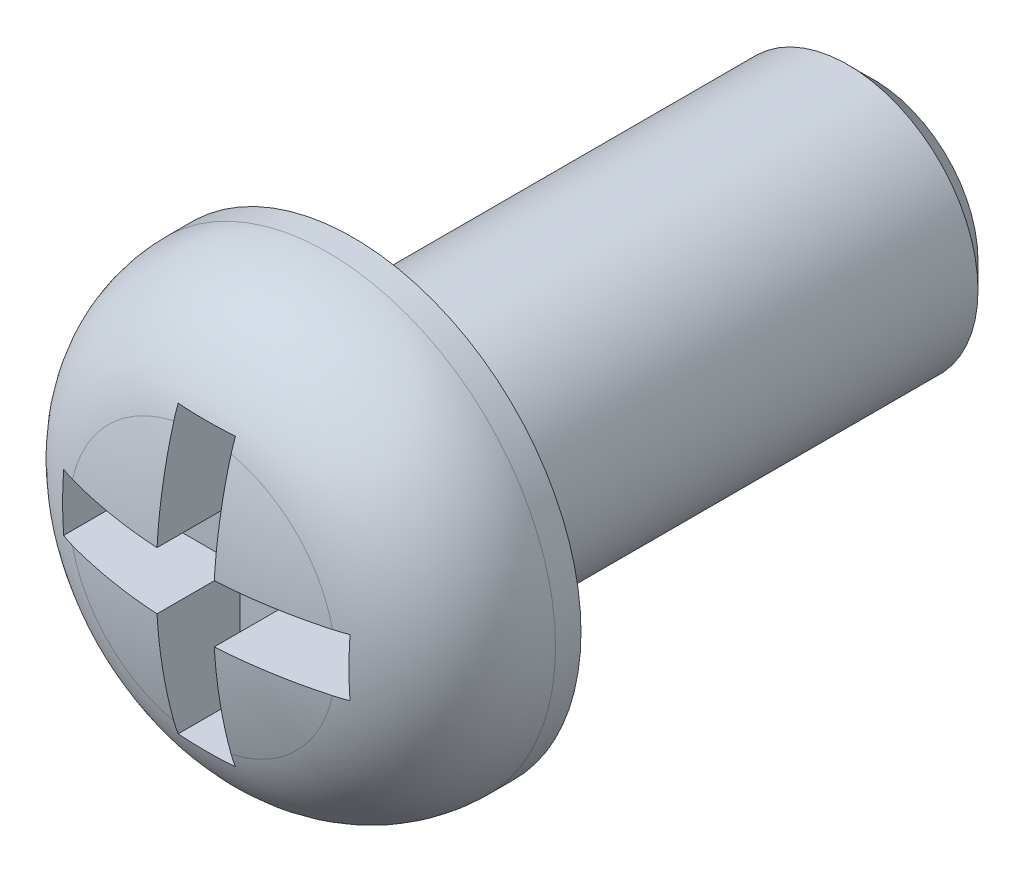
ISO-10303-21;
HEADER;
FILE_DESCRIPTION(('STEP AP214'),'2;1');
FILE_NAME('part.step','',(''),(''),'','','');
FILE_SCHEMA(('AUTOMOTIVE_DESIGN { 1 0 10303 214 1 1 1 1 }'));
ENDSEC;
DATA;
#1=APPLICATION_CONTEXT('core data for automotive mechanical design processes');
#2=APPLICATION_PROTOCOL_DEFINITION('international standard','automotive_design',2000,#1);
#3=PRODUCT_CONTEXT('',#1,'mechanical');
#4=PRODUCT('Part','Part','',(#3));
#5=PRODUCT_RELATED_PRODUCT_CATEGORY('part','',(#4));
#6=PRODUCT_DEFINITION_FORMATION('','',#4);
#7=PRODUCT_DEFINITION_CONTEXT('part definition',#1,'design');
#8=PRODUCT_DEFINITION('design','',#6,#7);
#9=PRODUCT_DEFINITION_SHAPE('','',#8);
#10=(LENGTH_UNIT() NAMED_UNIT(*) SI_UNIT(.MILLI.,.METRE.));
#11=(NAMED_UNIT(*) PLANE_ANGLE_UNIT() SI_UNIT($,.RADIAN.));
#12=(NAMED_UNIT(*) SI_UNIT($,.STERADIAN.) SOLID_ANGLE_UNIT());
#13=UNCERTAINTY_MEASURE_WITH_UNIT(LENGTH_MEASURE(1.E-05),#10,'distance_accuracy_value','');
#14=(GEOMETRIC_REPRESENTATION_CONTEXT(3) GLOBAL_UNCERTAINTY_ASSIGNED_CONTEXT((#13)) GLOBAL_UNIT_ASSIGNED_CONTEXT((#10,
#11,#12)) REPRESENTATION_CONTEXT('',''));
#15=CARTESIAN_POINT('',(0.,0.,0.));
#16=DIRECTION('',(0.,0.,1.));
#17=DIRECTION('',(1.,0.,0.));
#18=AXIS2_PLACEMENT_3D('',#15,#16,#17);
#19=CARTESIAN_POINT('',(0.,0.,-2.45032051282053));
#20=DIRECTION('',(0.,0.,1.));
#21=DIRECTION('',(0.,1.,0.));
#22=AXIS2_PLACEMENT_3D('',#19,#20,#21);
#23=SPHERICAL_SURFACE('',#22,3.75032051282053);
#24=CARTESIAN_POINT('',(-0.22,0.,-2.45032051282053));
#25=DIRECTION('',(1.,0.,0.));
#26=DIRECTION('',(0.,1.,0.));
#27=AXIS2_PLACEMENT_3D('',#24,#25,#26);
#28=CIRCLE('',#27,3.74386217012358);
#29=CARTESIAN_POINT('',(-0.22,0.998752254235364,1.1578643332679));
#30=VERTEX_POINT('',#29);
#31=CARTESIAN_POINT('',(-0.22,0.22,1.2870721543851));
#32=VERTEX_POINT('',#31);
#33=EDGE_CURVE('E190',#30,#32,#28,.T.);
#34=ORIENTED_EDGE('',*,*,#33,.F.);
#35=CARTESIAN_POINT('',(0.,0.,1.1578643332679));
#36=DIRECTION('',(0.,0.,-1.));
#37=DIRECTION('',(-1.,0.,0.));
#38=AXIS2_PLACEMENT_3D('',#35,#36,#37);
#39=CIRCLE('',#38,1.02269549003612);
#40=CARTESIAN_POINT('',(-0.998752254235368,0.22,1.1578643332679));
#41=VERTEX_POINT('',#40);
#42=EDGE_CURVE('E226',#30,#41,#39,.F.);
#43=ORIENTED_EDGE('',*,*,#42,.T.);
#44=CARTESIAN_POINT('',(0.,0.22,-2.45032051282053));
#45=DIRECTION('',(0.,-1.,0.));
#46=DIRECTION('',(1.,0.,0.));
#47=AXIS2_PLACEMENT_3D('',#44,#45,#46);
#48=CIRCLE('',#47,3.74386217012358);
#49=EDGE_CURVE('E193',#32,#41,#48,.T.);
#50=ORIENTED_EDGE('',*,*,#49,.F.);
#51=EDGE_LOOP('',(#34,#43,#50));
#52=FACE_BOUND('',#51,.T.);
#53=ADVANCED_FACE('F38',(#52),#23,.T.);
#54=CARTESIAN_POINT('',(0.,-0.22,-2.45032051282053));
#55=DIRECTION('',(0.,1.,0.));
#56=DIRECTION('',(-1.,0.,0.));
#57=AXIS2_PLACEMENT_3D('',#54,#55,#56);
#58=CIRCLE('',#57,3.74386217012358);
#59=CARTESIAN_POINT('',(-0.99875225423537,-0.22,1.1578643332679));
#60=VERTEX_POINT('',#59);
#61=CARTESIAN_POINT('',(-0.22,-0.22,1.2870721543851));
#62=VERTEX_POINT('',#61);
#63=EDGE_CURVE('E197',#60,#62,#58,.T.);
#64=ORIENTED_EDGE('',*,*,#63,.F.);
#65=CARTESIAN_POINT('',(0.,0.,1.1578643332679));
#66=DIRECTION('',(0.,0.,-1.));
#67=DIRECTION('',(-1.,0.,0.));
#68=AXIS2_PLACEMENT_3D('',#65,#66,#67);
#69=CIRCLE('',#68,1.02269549003612);
#70=CARTESIAN_POINT('',(-0.22,-0.998752254235372,1.1578643332679));
#71=VERTEX_POINT('',#70);
#72=EDGE_CURVE('E223',#60,#71,#69,.F.);
#73=ORIENTED_EDGE('',*,*,#72,.T.);
#74=CARTESIAN_POINT('',(-0.22,0.,-2.45032051282053));
#75=DIRECTION('',(1.,0.,0.));
#76=DIRECTION('',(0.,1.,0.));
#77=AXIS2_PLACEMENT_3D('',#74,#75,#76);
#78=CIRCLE('',#77,3.74386217012358);
#79=EDGE_CURVE('E200',#62,#71,#78,.T.);
#80=ORIENTED_EDGE('',*,*,#79,.F.);
#81=EDGE_LOOP('',(#64,#73,#80));
#82=FACE_BOUND('',#81,.T.);
#83=ADVANCED_FACE('F347',(#82),#23,.T.);
#84=CARTESIAN_POINT('',(0.22,0.,-2.45032051282053));
#85=DIRECTION('',(-1.,0.,0.));
#86=DIRECTION('',(0.,-1.,0.));
#87=AXIS2_PLACEMENT_3D('',#84,#85,#86);
#88=CIRCLE('',#87,3.74386217012358);
#89=CARTESIAN_POINT('',(0.22,-0.998752254235372,1.1578643332679));
#90=VERTEX_POINT('',#89);
#91=CARTESIAN_POINT('',(0.22,-0.22,1.2870721543851));
#92=VERTEX_POINT('',#91);
#93=EDGE_CURVE('E204',#90,#92,#88,.T.);
#94=ORIENTED_EDGE('',*,*,#93,.F.);
#95=CARTESIAN_POINT('',(0.,0.,1.1578643332679));
#96=DIRECTION('',(0.,0.,-1.));
#97=DIRECTION('',(-1.,0.,0.));
#98=AXIS2_PLACEMENT_3D('',#95,#96,#97);
#99=CIRCLE('',#98,1.02269549003612);
#100=CARTESIAN_POINT('',(0.998752254235369,-0.22,1.1578643332679));
#101=VERTEX_POINT('',#100);
#102=EDGE_CURVE('E220',#90,#101,#99,.F.);
#103=ORIENTED_EDGE('',*,*,#102,.T.);
#104=CARTESIAN_POINT('',(0.,-0.22,-2.45032051282053));
#105=DIRECTION('',(0.,1.,0.));
#106=DIRECTION('',(-1.,0.,0.));
#107=AXIS2_PLACEMENT_3D('',#104,#105,#106);
#108=CIRCLE('',#107,3.74386217012358);
#109=EDGE_CURVE('E207',#92,#101,#108,.T.);
#110=ORIENTED_EDGE('',*,*,#109,.F.);
#111=EDGE_LOOP('',(#94,#103,#110));
#112=FACE_BOUND('',#111,.T.);
#113=ADVANCED_FACE('F352',(#112),#23,.T.);
#114=CARTESIAN_POINT('',(0.,0.22,-2.45032051282053));
#115=DIRECTION('',(0.,-1.,0.));
#116=DIRECTION('',(1.,0.,0.));
#117=AXIS2_PLACEMENT_3D('',#114,#115,#116);
#118=CIRCLE('',#117,3.74386217012358);
#119=CARTESIAN_POINT('',(0.998752254235368,0.22,1.1578643332679));
#120=VERTEX_POINT('',#119);
#121=CARTESIAN_POINT('',(0.22,0.22,1.2870721543851));
#122=VERTEX_POINT('',#121);
#123=EDGE_CURVE('E211',#120,#122,#118,.T.);
#124=ORIENTED_EDGE('',*,*,#123,.F.);
#125=CARTESIAN_POINT('',(0.,0.,1.1578643332679));
#126=DIRECTION('',(0.,0.,-1.));
#127=DIRECTION('',(-1.,0.,0.));
#128=AXIS2_PLACEMENT_3D('',#125,#126,#127);
#129=CIRCLE('',#128,1.02269549003612);
#130=CARTESIAN_POINT('',(0.22,0.998752254235364,1.1578643332679));
#131=VERTEX_POINT('',#130);
#132=EDGE_CURVE('E217',#120,#131,#129,.F.);
#133=ORIENTED_EDGE('',*,*,#132,.T.);
#134=CARTESIAN_POINT('',(0.22,0.,-2.45032051282053));
#135=DIRECTION('',(-1.,0.,0.));
#136=DIRECTION('',(0.,-1.,0.));
#137=AXIS2_PLACEMENT_3D('',#134,#135,#136);
#138=CIRCLE('',#137,3.74386217012358);
#139=EDGE_CURVE('E214',#122,#131,#138,.T.);
#140=ORIENTED_EDGE('',*,*,#139,.F.);
#141=EDGE_LOOP('',(#124,#133,#140));
#142=FACE_BOUND('',#141,.T.);
#143=ADVANCED_FACE('F253',(#142),#23,.T.);
#144=CARTESIAN_POINT('',(0.,0.,33.7359697729939));
#145=DIRECTION('',(0.,0.,1.));
#146=DIRECTION('',(1.,0.,0.));
#147=AXIS2_PLACEMENT_3D('',#144,#145,#146);
#148=CYLINDRICAL_SURFACE('',#147,1.75);
#149=CARTESIAN_POINT('',(0.,0.,0.195763938447301));
#150=DIRECTION('',(0.,0.,-1.));
#151=DIRECTION('',(-1.,0.,0.));
#152=AXIS2_PLACEMENT_3D('',#149,#150,#151);
#153=CIRCLE('',#152,1.75);
#154=CARTESIAN_POINT('',(-1.75,0.,0.195763938447301));
#155=VERTEX_POINT('',#154);
#156=EDGE_CURVE('E484',#155,#155,#153,.T.);
#157=ORIENTED_EDGE('',*,*,#156,.T.);
#158=EDGE_LOOP('',(#157));
#159=FACE_BOUND('',#158,.T.);
#160=CARTESIAN_POINT('',(0.,0.,0.));
#161=DIRECTION('',(0.,0.,1.));
#162=DIRECTION('',(1.,0.,0.));
#163=AXIS2_PLACEMENT_3D('',#160,#161,#162);
#164=CIRCLE('',#163,1.75);
#165=CARTESIAN_POINT('',(1.75,0.,0.));
#166=VERTEX_POINT('',#165);
#167=EDGE_CURVE('E180',#166,#166,#164,.T.);
#168=ORIENTED_EDGE('',*,*,#167,.T.);
#169=EDGE_LOOP('',(#168));
#170=FACE_BOUND('',#169,.T.);
#171=ADVANCED_FACE('F356',(#159,#170),#148,.T.);
#172=CARTESIAN_POINT('',(0.,1.75,0.));
#173=DIRECTION('',(0.,0.,1.));
#174=DIRECTION('',(1.,0.,0.));
#175=AXIS2_PLACEMENT_3D('',#172,#173,#174);
#176=PLANE('',#175);
#177=ORIENTED_EDGE('',*,*,#167,.F.);
#178=EDGE_LOOP('',(#177));
#179=FACE_BOUND('',#178,.T.);
#180=CARTESIAN_POINT('',(0.,0.,0.));
#181=DIRECTION('',(0.,0.,1.));
#182=DIRECTION('',(1.,0.,0.));
#183=AXIS2_PLACEMENT_3D('',#180,#181,#182);
#184=CIRCLE('',#183,1.);
#185=CARTESIAN_POINT('',(1.,0.,0.));
#186=VERTEX_POINT('',#185);
#187=EDGE_CURVE('E173',#186,#186,#184,.T.);
#188=ORIENTED_EDGE('',*,*,#187,.T.);
#189=EDGE_LOOP('',(#188));
#190=FACE_BOUND('',#189,.T.);
#191=ADVANCED_FACE('F362',(#179,#190),#176,.F.);
#192=CARTESIAN_POINT('',(0.,0.,33.7359697729939));
#193=DIRECTION('',(0.,0.,1.));
#194=DIRECTION('',(1.,0.,0.));
#195=AXIS2_PLACEMENT_3D('',#192,#193,#194);
#196=CYLINDRICAL_SURFACE('',#195,1.);
#197=CARTESIAN_POINT('',(0.,0.,-3.8));
#198=DIRECTION('',(0.,0.,1.));
#199=DIRECTION('',(1.,0.,0.));
#200=AXIS2_PLACEMENT_3D('',#197,#198,#199);
#201=CIRCLE('',#200,1.);
#202=CARTESIAN_POINT('',(1.,0.,-3.8));
#203=VERTEX_POINT('',#202);
#204=EDGE_CURVE('E47',#203,#203,#201,.T.);
#205=ORIENTED_EDGE('',*,*,#204,.T.);
#206=EDGE_LOOP('',(#205));
#207=FACE_BOUND('',#206,.T.);
#208=ORIENTED_EDGE('',*,*,#187,.F.);
#209=EDGE_LOOP('',(#208));
#210=FACE_BOUND('',#209,.T.);
#211=ADVANCED_FACE('F491',(#207,#210),#196,.T.);
#212=CARTESIAN_POINT('',(0.,1.,-4.));
#213=DIRECTION('',(0.,0.,1.));
#214=DIRECTION('',(1.,0.,0.));
#215=AXIS2_PLACEMENT_3D('',#212,#213,#214);
#216=PLANE('',#215);
#217=CARTESIAN_POINT('',(0.,0.,-4.));
#218=DIRECTION('',(0.,0.,1.));
#219=DIRECTION('',(1.,0.,0.));
#220=AXIS2_PLACEMENT_3D('',#217,#218,#219);
#221=CIRCLE('',#220,0.800000000000003);
#222=CARTESIAN_POINT('',(0.800000000000003,0.,-4.));
#223=VERTEX_POINT('',#222);
#224=EDGE_CURVE('E11',#223,#223,#221,.F.);
#225=ORIENTED_EDGE('',*,*,#224,.T.);
#226=EDGE_LOOP('',(#225));
#227=FACE_BOUND('',#226,.T.);
#228=ADVANCED_FACE('F500',(#227),#216,.F.);
#229=CARTESIAN_POINT('',(0.22,0.22,0.65));
#230=DIRECTION('',(-1.,0.,0.));
#231=DIRECTION('',(0.,-1.,0.));
#232=AXIS2_PLACEMENT_3D('',#229,#230,#231);
#233=PLANE('',#232);
#234=ORIENTED_EDGE('',*,*,#139,.T.);
#235=CARTESIAN_POINT('',(0.22,0.998752254235364,1.1578643332679));
#236=CARTESIAN_POINT('',(0.22,1.01592019967968,1.15311330343602));
#237=CARTESIAN_POINT('',(0.22,1.0329414774564,1.14792268735521));
#238=CARTESIAN_POINT('',(0.22,1.06669072654649,1.13666227306266));
#239=CARTESIAN_POINT('',(0.22,1.083418697358,1.13059247334668));
#240=CARTESIAN_POINT('',(0.22,1.1,1.12408308587755));
#241=B_SPLINE_CURVE_WITH_KNOTS('',3,(#235,#236,#237,#238,#239,#240),.UNSPECIFIED.,.F.,.F.,(4,2,
4),(0.,0.0533853681457087,0.106770827632),.UNSPECIFIED.);
#242=CARTESIAN_POINT('',(0.22,1.1,1.12408308587755));
#243=VERTEX_POINT('',#242);
#244=EDGE_CURVE('E62',#131,#243,#241,.T.);
#245=ORIENTED_EDGE('',*,*,#244,.T.);
#246=DIRECTION('',(0.,0.,1.));
#247=VECTOR('',#246,1.);
#248=CARTESIAN_POINT('',(0.22,1.1,0.65));
#249=LINE('',#248,#247);
#250=CARTESIAN_POINT('',(0.22,1.1,0.65));
#251=VERTEX_POINT('',#250);
#252=EDGE_CURVE('E167',#251,#243,#249,.T.);
#253=ORIENTED_EDGE('',*,*,#252,.F.);
#254=DIRECTION('',(0.,-1.,0.));
#255=VECTOR('',#254,1.);
#256=CARTESIAN_POINT('',(0.22,0.22,0.65));
#257=LINE('',#256,#255);
#258=CARTESIAN_POINT('',(0.22,0.22,0.65));
#259=VERTEX_POINT('',#258);
#260=EDGE_CURVE('E154',#251,#259,#257,.T.);
#261=ORIENTED_EDGE('',*,*,#260,.T.);
#262=DIRECTION('',(0.,0.,1.));
#263=VECTOR('',#262,1.);
#264=CARTESIAN_POINT('',(0.22,0.22,0.65));
#265=LINE('',#264,#263);
#266=EDGE_CURVE('E174',#259,#122,#265,.T.);
#267=ORIENTED_EDGE('',*,*,#266,.T.);
#268=EDGE_LOOP('',(#234,#245,#253,#261,#267));
#269=FACE_BOUND('',#268,.T.);
#270=ADVANCED_FACE('F171',(#269),#233,.T.);
#271=CARTESIAN_POINT('',(1.1,0.22,0.65));
#272=DIRECTION('',(0.,-1.,0.));
#273=DIRECTION('',(1.,0.,0.));
#274=AXIS2_PLACEMENT_3D('',#271,#272,#273);
#275=PLANE('',#274);
#276=DIRECTION('',(0.,0.,1.));
#277=VECTOR('',#276,1.);
#278=CARTESIAN_POINT('',(1.1,0.22,0.65));
#279=LINE('',#278,#277);
#280=CARTESIAN_POINT('',(1.1,0.22,0.65));
#281=VERTEX_POINT('',#280);
#282=CARTESIAN_POINT('',(1.1,0.22,1.12408308587755));
#283=VERTEX_POINT('',#282);
#284=EDGE_CURVE('E183',#281,#283,#279,.T.);
#285=ORIENTED_EDGE('',*,*,#284,.T.);
#286=CARTESIAN_POINT('',(1.1,0.22,1.12408308587755));
#287=CARTESIAN_POINT('',(1.083418697358,0.22,1.13059247334668));
#288=CARTESIAN_POINT('',(1.0666907265465,0.22,1.13666227306266));
#289=CARTESIAN_POINT('',(1.0329414774564,0.22,1.14792268735521));
#290=CARTESIAN_POINT('',(1.01592019967969,0.22,1.15311330343602));
#291=CARTESIAN_POINT('',(0.998752254235368,0.22,1.1578643332679));
#292=B_SPLINE_CURVE_WITH_KNOTS('',3,(#286,#287,#288,#289,#290,#291),.UNSPECIFIED.,.F.,.F.,(4,2,
4),(0.,0.0533854594862894,0.106770827631996),.UNSPECIFIED.);
#293=EDGE_CURVE('E309',#283,#120,#292,.T.);
#294=ORIENTED_EDGE('',*,*,#293,.T.);
#295=ORIENTED_EDGE('',*,*,#123,.T.);
#296=ORIENTED_EDGE('',*,*,#266,.F.);
#297=DIRECTION('',(1.,0.,0.));
#298=VECTOR('',#297,1.);
#299=CARTESIAN_POINT('',(1.1,0.22,0.65));
#300=LINE('',#299,#298);
#301=EDGE_CURVE('E161',#259,#281,#300,.T.);
#302=ORIENTED_EDGE('',*,*,#301,.T.);
#303=EDGE_LOOP('',(#285,#294,#295,#296,#302));
#304=FACE_BOUND('',#303,.T.);
#305=ADVANCED_FACE('F449',(#304),#275,.T.);
#306=CARTESIAN_POINT('',(1.1,-0.22,0.65));
#307=DIRECTION('',(-1.,0.,0.));
#308=DIRECTION('',(0.,-1.,0.));
#309=AXIS2_PLACEMENT_3D('',#306,#307,#308);
#310=PLANE('',#309);
#311=DIRECTION('',(0.,0.,1.));
#312=VECTOR('',#311,1.);
#313=CARTESIAN_POINT('',(1.1,-0.22,0.65));
#314=LINE('',#313,#312);
#315=CARTESIAN_POINT('',(1.1,-0.22,0.65));
#316=VERTEX_POINT('',#315);
#317=CARTESIAN_POINT('',(1.1,-0.22,1.12408308587755));
#318=VERTEX_POINT('',#317);
#319=EDGE_CURVE('E444',#316,#318,#314,.T.);
#320=ORIENTED_EDGE('',*,*,#319,.T.);
#321=CARTESIAN_POINT('',(1.1,-0.22,1.12408308587755));
#322=CARTESIAN_POINT('',(1.1,-0.183379526702332,1.12694377121496));
#323=CARTESIAN_POINT('',(1.1,-0.146704209263485,1.1290524034163));
#324=CARTESIAN_POINT('',(1.1,-0.0733525410626625,1.13183628920406));
#325=CARTESIAN_POINT('',(1.1,-0.0366762705313313,1.13251363820852));
#326=CARTESIAN_POINT('',(1.1,0.0366762705313312,1.13251363820852));
#327=CARTESIAN_POINT('',(1.1,0.0733525410626625,1.13183628920406));
#328=CARTESIAN_POINT('',(1.1,0.146704209263485,1.1290524034163));
#329=CARTESIAN_POINT('',(1.1,0.183379526702332,1.12694377121496));
#330=CARTESIAN_POINT('',(1.1,0.22,1.12408308587755));
#331=B_SPLINE_CURVE_WITH_KNOTS('',3,(#321,#322,#323,#324,#325,#326,#327,#328,#329,#330),
.UNSPECIFIED.,.F.,.F.,(4,2,2,2,4),(0.,0.110182352719953,0.220203284899408,0.330224217078864,
0.440406569798817),.UNSPECIFIED.);
#332=EDGE_CURVE('E301',#318,#283,#331,.T.);
#333=ORIENTED_EDGE('',*,*,#332,.T.);
#334=ORIENTED_EDGE('',*,*,#284,.F.);
#335=DIRECTION('',(0.,-1.,0.));
#336=VECTOR('',#335,1.);
#337=CARTESIAN_POINT('',(1.1,0.,0.65));
#338=LINE('',#337,#336);
#339=EDGE_CURVE('E451',#281,#316,#338,.T.);
#340=ORIENTED_EDGE('',*,*,#339,.T.);
#341=EDGE_LOOP('',(#320,#333,#334,#340));
#342=FACE_BOUND('',#341,.T.);
#343=ADVANCED_FACE('F450',(#342),#310,.T.);
#344=CARTESIAN_POINT('',(0.22,-0.22,0.65));
#345=DIRECTION('',(0.,1.,0.));
#346=DIRECTION('',(-1.,0.,0.));
#347=AXIS2_PLACEMENT_3D('',#344,#345,#346);
#348=PLANE('',#347);
#349=ORIENTED_EDGE('',*,*,#109,.T.);
#350=CARTESIAN_POINT('',(0.998752254235369,-0.22,1.1578643332679));
#351=CARTESIAN_POINT('',(1.01592019967969,-0.22,1.15311330343601));
#352=CARTESIAN_POINT('',(1.0329414774564,-0.22,1.14792268735521));
#353=CARTESIAN_POINT('',(1.0666907265465,-0.22,1.13666227306266));
#354=CARTESIAN_POINT('',(1.083418697358,-0.22,1.13059247334668));
#355=CARTESIAN_POINT('',(1.1,-0.22,1.12408308587755));
#356=B_SPLINE_CURVE_WITH_KNOTS('',3,(#350,#351,#352,#353,#354,#355),.UNSPECIFIED.,.F.,.F.,(4,2,
4),(0.,0.0533853681457065,0.106770827631995),.UNSPECIFIED.);
#357=EDGE_CURVE('E293',#101,#318,#356,.T.);
#358=ORIENTED_EDGE('',*,*,#357,.T.);
#359=ORIENTED_EDGE('',*,*,#319,.F.);
#360=DIRECTION('',(-1.,0.,0.));
#361=VECTOR('',#360,1.);
#362=CARTESIAN_POINT('',(0.22,-0.22,0.65));
#363=LINE('',#362,#361);
#364=CARTESIAN_POINT('',(0.22,-0.22,0.65));
#365=VERTEX_POINT('',#364);
#366=EDGE_CURVE('E454',#316,#365,#363,.T.);
#367=ORIENTED_EDGE('',*,*,#366,.T.);
#368=DIRECTION('',(0.,0.,1.));
#369=VECTOR('',#368,1.);
#370=CARTESIAN_POINT('',(0.22,-0.22,0.65));
#371=LINE('',#370,#369);
#372=EDGE_CURVE('E441',#365,#92,#371,.T.);
#373=ORIENTED_EDGE('',*,*,#372,.T.);
#374=EDGE_LOOP('',(#349,#358,#359,#367,#373));
#375=FACE_BOUND('',#374,.T.);
#376=ADVANCED_FACE('F547',(#375),#348,.T.);
#377=CARTESIAN_POINT('',(0.22,-1.1,0.65));
#378=DIRECTION('',(-1.,0.,0.));
#379=DIRECTION('',(0.,-1.,0.));
#380=AXIS2_PLACEMENT_3D('',#377,#378,#379);
#381=PLANE('',#380);
#382=DIRECTION('',(0.,0.,1.));
#383=VECTOR('',#382,1.);
#384=CARTESIAN_POINT('',(0.22,-1.1,0.65));
#385=LINE('',#384,#383);
#386=CARTESIAN_POINT('',(0.22,-1.1,0.65));
#387=VERTEX_POINT('',#386);
#388=CARTESIAN_POINT('',(0.22,-1.1,1.12408308587755));
#389=VERTEX_POINT('',#388);
#390=EDGE_CURVE('E435',#387,#389,#385,.T.);
#391=ORIENTED_EDGE('',*,*,#390,.T.);
#392=CARTESIAN_POINT('',(0.22,-1.1,1.12408308587755));
#393=CARTESIAN_POINT('',(0.22,-1.083418697358,1.13059247334668));
#394=CARTESIAN_POINT('',(0.22,-1.0666907265465,1.13666227306266));
#395=CARTESIAN_POINT('',(0.22,-1.0329414774564,1.14792268735521));
#396=CARTESIAN_POINT('',(0.22,-1.01592019967969,1.15311330343601));
#397=CARTESIAN_POINT('',(0.22,-0.998752254235372,1.1578643332679));
#398=B_SPLINE_CURVE_WITH_KNOTS('',3,(#392,#393,#394,#395,#396,#397),.UNSPECIFIED.,.F.,.F.,(4,2,
4),(0.,0.0533854594862871,0.106770827631992),.UNSPECIFIED.);
#399=EDGE_CURVE('E285',#389,#90,#398,.T.);
#400=ORIENTED_EDGE('',*,*,#399,.T.);
#401=ORIENTED_EDGE('',*,*,#93,.T.);
#402=ORIENTED_EDGE('',*,*,#372,.F.);
#403=DIRECTION('',(0.,-1.,0.));
#404=VECTOR('',#403,1.);
#405=CARTESIAN_POINT('',(0.22,-1.1,0.65));
#406=LINE('',#405,#404);
#407=EDGE_CURVE('E456',#365,#387,#406,.T.);
#408=ORIENTED_EDGE('',*,*,#407,.T.);
#409=EDGE_LOOP('',(#391,#400,#401,#402,#408));
#410=FACE_BOUND('',#409,.T.);
#411=ADVANCED_FACE('F554',(#410),#381,.T.);
#412=CARTESIAN_POINT('',(-0.22,-1.1,0.65));
#413=DIRECTION('',(0.,1.,0.));
#414=DIRECTION('',(-1.,0.,0.));
#415=AXIS2_PLACEMENT_3D('',#412,#413,#414);
#416=PLANE('',#415);
#417=DIRECTION('',(0.,0.,1.));
#418=VECTOR('',#417,1.);
#419=CARTESIAN_POINT('',(-0.22,-1.1,0.65));
#420=LINE('',#419,#418);
#421=CARTESIAN_POINT('',(-0.22,-1.1,0.65));
#422=VERTEX_POINT('',#421);
#423=CARTESIAN_POINT('',(-0.22,-1.1,1.12408308587755));
#424=VERTEX_POINT('',#423);
#425=EDGE_CURVE('E433',#422,#424,#420,.T.);
#426=ORIENTED_EDGE('',*,*,#425,.T.);
#427=CARTESIAN_POINT('',(-0.22,-1.1,1.12408308587755));
#428=CARTESIAN_POINT('',(-0.183379526702332,-1.1,1.12694377121496));
#429=CARTESIAN_POINT('',(-0.146704209263485,-1.1,1.1290524034163));
#430=CARTESIAN_POINT('',(-0.0733525410626627,-1.1,1.13183628920406));
#431=CARTESIAN_POINT('',(-0.0366762705313314,-1.1,1.13251363820852));
#432=CARTESIAN_POINT('',(0.036676270531331,-1.1,1.13251363820852));
#433=CARTESIAN_POINT('',(0.0733525410626621,-1.1,1.13183628920406));
#434=CARTESIAN_POINT('',(0.146704209263484,-1.1,1.1290524034163));
#435=CARTESIAN_POINT('',(0.183379526702332,-1.1,1.12694377121496));
#436=CARTESIAN_POINT('',(0.22,-1.1,1.12408308587755));
#437=B_SPLINE_CURVE_WITH_KNOTS('',3,(#427,#428,#429,#430,#431,#432,#433,#434,#435,#436),
.UNSPECIFIED.,.F.,.F.,(4,2,2,2,4),(0.,0.110182352719953,0.220203284899408,0.330224217078863,
0.440406569798816),.UNSPECIFIED.);
#438=EDGE_CURVE('E277',#424,#389,#437,.T.);
#439=ORIENTED_EDGE('',*,*,#438,.T.);
#440=ORIENTED_EDGE('',*,*,#390,.F.);
#441=DIRECTION('',(-1.,0.,0.));
#442=VECTOR('',#441,1.);
#443=CARTESIAN_POINT('',(0.,-1.1,0.65));
#444=LINE('',#443,#442);
#445=EDGE_CURVE('E462',#387,#422,#444,.T.);
#446=ORIENTED_EDGE('',*,*,#445,.T.);
#447=EDGE_LOOP('',(#426,#439,#440,#446));
#448=FACE_BOUND('',#447,.T.);
#449=ADVANCED_FACE('F561',(#448),#416,.T.);
#450=CARTESIAN_POINT('',(-0.22,-0.22,0.65));
#451=DIRECTION('',(1.,0.,0.));
#452=DIRECTION('',(0.,1.,0.));
#453=AXIS2_PLACEMENT_3D('',#450,#451,#452);
#454=PLANE('',#453);
#455=ORIENTED_EDGE('',*,*,#79,.T.);
#456=CARTESIAN_POINT('',(-0.22,-0.998752254235372,1.1578643332679));
#457=CARTESIAN_POINT('',(-0.22,-1.01592019967969,1.15311330343601));
#458=CARTESIAN_POINT('',(-0.22,-1.0329414774564,1.14792268735521));
#459=CARTESIAN_POINT('',(-0.22,-1.0666907265465,1.13666227306266));
#460=CARTESIAN_POINT('',(-0.22,-1.083418697358,1.13059247334668));
#461=CARTESIAN_POINT('',(-0.22,-1.1,1.12408308587755));
#462=B_SPLINE_CURVE_WITH_KNOTS('',3,(#456,#457,#458,#459,#460,#461),.UNSPECIFIED.,.F.,.F.,(4,2,
4),(0.,0.053385368145705,0.106770827631992),.UNSPECIFIED.);
#463=EDGE_CURVE('E269',#71,#424,#462,.T.);
#464=ORIENTED_EDGE('',*,*,#463,.T.);
#465=ORIENTED_EDGE('',*,*,#425,.F.);
#466=DIRECTION('',(0.,1.,0.));
#467=VECTOR('',#466,1.);
#468=CARTESIAN_POINT('',(-0.22,-0.22,0.65));
#469=LINE('',#468,#467);
#470=CARTESIAN_POINT('',(-0.22,-0.22,0.65));
#471=VERTEX_POINT('',#470);
#472=EDGE_CURVE('E431',#422,#471,#469,.T.);
#473=ORIENTED_EDGE('',*,*,#472,.T.);
#474=DIRECTION('',(0.,0.,1.));
#475=VECTOR('',#474,1.);
#476=CARTESIAN_POINT('',(-0.22,-0.22,0.65));
#477=LINE('',#476,#475);
#478=EDGE_CURVE('E424',#471,#62,#477,.T.);
#479=ORIENTED_EDGE('',*,*,#478,.T.);
#480=EDGE_LOOP('',(#455,#464,#465,#473,#479));
#481=FACE_BOUND('',#480,.T.);
#482=ADVANCED_FACE('F429',(#481),#454,.T.);
#483=CARTESIAN_POINT('',(-1.1,-0.22,0.65));
#484=DIRECTION('',(0.,1.,0.));
#485=DIRECTION('',(-1.,0.,0.));
#486=AXIS2_PLACEMENT_3D('',#483,#484,#485);
#487=PLANE('',#486);
#488=DIRECTION('',(0.,0.,1.));
#489=VECTOR('',#488,1.);
#490=CARTESIAN_POINT('',(-1.1,-0.22,0.65));
#491=LINE('',#490,#489);
#492=CARTESIAN_POINT('',(-1.1,-0.22,0.65));
#493=VERTEX_POINT('',#492);
#494=CARTESIAN_POINT('',(-1.1,-0.22,1.12408308587755));
#495=VERTEX_POINT('',#494);
#496=EDGE_CURVE('E415',#493,#495,#491,.T.);
#497=ORIENTED_EDGE('',*,*,#496,.T.);
#498=CARTESIAN_POINT('',(-1.1,-0.22,1.12408308587755));
#499=CARTESIAN_POINT('',(-1.083418697358,-0.22,1.13059247334668));
#500=CARTESIAN_POINT('',(-1.0666907265465,-0.22,1.13666227306266));
#501=CARTESIAN_POINT('',(-1.0329414774564,-0.22,1.14792268735521));
#502=CARTESIAN_POINT('',(-1.01592019967969,-0.22,1.15311330343602));
#503=CARTESIAN_POINT('',(-0.998752254235369,-0.22,1.1578643332679));
#504=B_SPLINE_CURVE_WITH_KNOTS('',3,(#498,#499,#500,#501,#502,#503),.UNSPECIFIED.,.F.,.F.,(4,2,
4),(0.,0.0533854594862885,0.106770827631994),.UNSPECIFIED.);
#505=EDGE_CURVE('E261',#495,#60,#504,.T.);
#506=ORIENTED_EDGE('',*,*,#505,.T.);
#507=ORIENTED_EDGE('',*,*,#63,.T.);
#508=ORIENTED_EDGE('',*,*,#478,.F.);
#509=DIRECTION('',(-1.,0.,0.));
#510=VECTOR('',#509,1.);
#511=CARTESIAN_POINT('',(-1.1,-0.22,0.65));
#512=LINE('',#511,#510);
#513=EDGE_CURVE('E422',#471,#493,#512,.T.);
#514=ORIENTED_EDGE('',*,*,#513,.T.);
#515=EDGE_LOOP('',(#497,#506,#507,#508,#514));
#516=FACE_BOUND('',#515,.T.);
#517=ADVANCED_FACE('F419',(#516),#487,.T.);
#518=CARTESIAN_POINT('',(-1.1,0.22,0.65));
#519=DIRECTION('',(1.,0.,0.));
#520=DIRECTION('',(0.,1.,0.));
#521=AXIS2_PLACEMENT_3D('',#518,#519,#520);
#522=PLANE('',#521);
#523=DIRECTION('',(0.,0.,1.));
#524=VECTOR('',#523,1.);
#525=CARTESIAN_POINT('',(-1.1,0.22,0.65));
#526=LINE('',#525,#524);
#527=CARTESIAN_POINT('',(-1.1,0.22,0.65));
#528=VERTEX_POINT('',#527);
#529=CARTESIAN_POINT('',(-1.1,0.22,1.12408308587755));
#530=VERTEX_POINT('',#529);
#531=EDGE_CURVE('E418',#528,#530,#526,.T.);
#532=ORIENTED_EDGE('',*,*,#531,.T.);
#533=CARTESIAN_POINT('',(-1.1,0.22,1.12408308587755));
#534=CARTESIAN_POINT('',(-1.1,0.183379526702332,1.12694377121496));
#535=CARTESIAN_POINT('',(-1.1,0.146704209263485,1.1290524034163));
#536=CARTESIAN_POINT('',(-1.1,0.0733525410626627,1.13183628920406));
#537=CARTESIAN_POINT('',(-1.1,0.0366762705313314,1.13251363820852));
#538=CARTESIAN_POINT('',(-1.1,-0.036676270531331,1.13251363820852));
#539=CARTESIAN_POINT('',(-1.1,-0.0733525410626621,1.13183628920406));
#540=CARTESIAN_POINT('',(-1.1,-0.146704209263484,1.1290524034163));
#541=CARTESIAN_POINT('',(-1.1,-0.183379526702332,1.12694377121496));
#542=CARTESIAN_POINT('',(-1.1,-0.22,1.12408308587755));
#543=B_SPLINE_CURVE_WITH_KNOTS('',3,(#533,#534,#535,#536,#537,#538,#539,#540,#541,#542),
.UNSPECIFIED.,.F.,.F.,(4,2,2,2,4),(0.,0.110182352719953,0.220203284899408,0.330224217078863,
0.440406569798816),.UNSPECIFIED.);
#544=EDGE_CURVE('E238',#530,#495,#543,.T.);
#545=ORIENTED_EDGE('',*,*,#544,.T.);
#546=ORIENTED_EDGE('',*,*,#496,.F.);
#547=DIRECTION('',(0.,1.,0.));
#548=VECTOR('',#547,1.);
#549=CARTESIAN_POINT('',(-1.1,0.,0.65));
#550=LINE('',#549,#548);
#551=EDGE_CURVE('E467',#493,#528,#550,.T.);
#552=ORIENTED_EDGE('',*,*,#551,.T.);
#553=EDGE_LOOP('',(#532,#545,#546,#552));
#554=FACE_BOUND('',#553,.T.);
#555=ADVANCED_FACE('F344',(#554),#522,.T.);
#556=CARTESIAN_POINT('',(-0.22,0.22,0.65));
#557=DIRECTION('',(0.,-1.,0.));
#558=DIRECTION('',(1.,0.,0.));
#559=AXIS2_PLACEMENT_3D('',#556,#557,#558);
#560=PLANE('',#559);
#561=ORIENTED_EDGE('',*,*,#49,.T.);
#562=CARTESIAN_POINT('',(-0.998752254235368,0.22,1.1578643332679));
#563=CARTESIAN_POINT('',(-1.01592019967969,0.22,1.15311330343602));
#564=CARTESIAN_POINT('',(-1.0329414774564,0.22,1.14792268735521));
#565=CARTESIAN_POINT('',(-1.0666907265465,0.22,1.13666227306266));
#566=CARTESIAN_POINT('',(-1.083418697358,0.22,1.13059247334668));
#567=CARTESIAN_POINT('',(-1.1,0.22,1.12408308587755));
#568=B_SPLINE_CURVE_WITH_KNOTS('',3,(#562,#563,#564,#565,#566,#567),.UNSPECIFIED.,.F.,.F.,(4,2,
4),(0.,0.0533853681457073,0.106770827631996),.UNSPECIFIED.);
#569=EDGE_CURVE('E230',#41,#530,#568,.T.);
#570=ORIENTED_EDGE('',*,*,#569,.T.);
#571=ORIENTED_EDGE('',*,*,#531,.F.);
#572=DIRECTION('',(1.,0.,0.));
#573=VECTOR('',#572,1.);
#574=CARTESIAN_POINT('',(-0.22,0.22,0.65));
#575=LINE('',#574,#573);
#576=CARTESIAN_POINT('',(-0.22,0.22,0.65));
#577=VERTEX_POINT('',#576);
#578=EDGE_CURVE('E469',#528,#577,#575,.T.);
#579=ORIENTED_EDGE('',*,*,#578,.T.);
#580=DIRECTION('',(0.,0.,1.));
#581=VECTOR('',#580,1.);
#582=CARTESIAN_POINT('',(-0.22,0.22,0.65));
#583=LINE('',#582,#581);
#584=EDGE_CURVE('E475',#577,#32,#583,.T.);
#585=ORIENTED_EDGE('',*,*,#584,.T.);
#586=EDGE_LOOP('',(#561,#570,#571,#579,#585));
#587=FACE_BOUND('',#586,.T.);
#588=ADVANCED_FACE('F245',(#587),#560,.T.);
#589=CARTESIAN_POINT('',(-0.22,1.1,0.65));
#590=DIRECTION('',(1.,0.,0.));
#591=DIRECTION('',(0.,1.,0.));
#592=AXIS2_PLACEMENT_3D('',#589,#590,#591);
#593=PLANE('',#592);
#594=DIRECTION('',(0.,0.,1.));
#595=VECTOR('',#594,1.);
#596=CARTESIAN_POINT('',(-0.22,1.1,0.65));
#597=LINE('',#596,#595);
#598=CARTESIAN_POINT('',(-0.22,1.1,0.65));
#599=VERTEX_POINT('',#598);
#600=CARTESIAN_POINT('',(-0.22,1.1,1.12408308587755));
#601=VERTEX_POINT('',#600);
#602=EDGE_CURVE('E168',#599,#601,#597,.T.);
#603=ORIENTED_EDGE('',*,*,#602,.T.);
#604=CARTESIAN_POINT('',(-0.22,1.1,1.12408308587755));
#605=CARTESIAN_POINT('',(-0.22,1.083418697358,1.13059247334668));
#606=CARTESIAN_POINT('',(-0.22,1.06669072654649,1.13666227306266));
#607=CARTESIAN_POINT('',(-0.22,1.0329414774564,1.14792268735521));
#608=CARTESIAN_POINT('',(-0.22,1.01592019967968,1.15311330343602));
#609=CARTESIAN_POINT('',(-0.22,0.998752254235365,1.1578643332679));
#610=B_SPLINE_CURVE_WITH_KNOTS('',3,(#604,#605,#606,#607,#608,#609),.UNSPECIFIED.,.F.,.F.,(4,2,
4),(0.,0.0533854594862907,0.106770827631999),.UNSPECIFIED.);
#611=EDGE_CURVE('E328',#601,#30,#610,.T.);
#612=ORIENTED_EDGE('',*,*,#611,.T.);
#613=ORIENTED_EDGE('',*,*,#33,.T.);
#614=ORIENTED_EDGE('',*,*,#584,.F.);
#615=DIRECTION('',(0.,1.,0.));
#616=VECTOR('',#615,1.);
#617=CARTESIAN_POINT('',(-0.22,1.1,0.65));
#618=LINE('',#617,#616);
#619=EDGE_CURVE('E472',#577,#599,#618,.T.);
#620=ORIENTED_EDGE('',*,*,#619,.T.);
#621=EDGE_LOOP('',(#603,#612,#613,#614,#620));
#622=FACE_BOUND('',#621,.T.);
#623=ADVANCED_FACE('F337',(#622),#593,.T.);
#624=CARTESIAN_POINT('',(0.,1.1,0.65));
#625=DIRECTION('',(0.,-1.,0.));
#626=DIRECTION('',(0.,0.,-1.));
#627=AXIS2_PLACEMENT_3D('',#624,#625,#626);
#628=PLANE('',#627);
#629=ORIENTED_EDGE('',*,*,#252,.T.);
#630=CARTESIAN_POINT('',(0.22,1.1,1.12408308587755));
#631=CARTESIAN_POINT('',(0.183379526702332,1.1,1.12694377121496));
#632=CARTESIAN_POINT('',(0.146704209263485,1.1,1.1290524034163));
#633=CARTESIAN_POINT('',(0.0733525410626626,1.1,1.13183628920406));
#634=CARTESIAN_POINT('',(0.0366762705313314,1.1,1.13251363820852));
#635=CARTESIAN_POINT('',(-0.0366762705313311,1.1,1.13251363820852));
#636=CARTESIAN_POINT('',(-0.0733525410626623,1.1,1.13183628920406));
#637=CARTESIAN_POINT('',(-0.146704209263484,1.1,1.1290524034163));
#638=CARTESIAN_POINT('',(-0.183379526702332,1.1,1.12694377121496));
#639=CARTESIAN_POINT('',(-0.22,1.1,1.12408308587755));
#640=B_SPLINE_CURVE_WITH_KNOTS('',3,(#630,#631,#632,#633,#634,#635,#636,#637,#638,#639),
.UNSPECIFIED.,.F.,.F.,(4,2,2,2,4),(0.,0.110182352719953,0.220203284899408,0.330224217078864,
0.440406569798817),.UNSPECIFIED.);
#641=EDGE_CURVE('E54',#243,#601,#640,.T.);
#642=ORIENTED_EDGE('',*,*,#641,.T.);
#643=ORIENTED_EDGE('',*,*,#602,.F.);
#644=DIRECTION('',(1.,0.,0.));
#645=VECTOR('',#644,1.);
#646=CARTESIAN_POINT('',(0.22,1.1,0.65));
#647=LINE('',#646,#645);
#648=EDGE_CURVE('E158',#599,#251,#647,.T.);
#649=ORIENTED_EDGE('',*,*,#648,.T.);
#650=EDGE_LOOP('',(#629,#642,#643,#649));
#651=FACE_BOUND('',#650,.T.);
#652=ADVANCED_FACE('F166',(#651),#628,.T.);
#653=CARTESIAN_POINT('',(-0.22,1.1,0.65));
#654=DIRECTION('',(0.,0.,1.));
#655=DIRECTION('',(1.,0.,0.));
#656=AXIS2_PLACEMENT_3D('',#653,#654,#655);
#657=PLANE('',#656);
#658=ORIENTED_EDGE('',*,*,#648,.F.);
#659=ORIENTED_EDGE('',*,*,#619,.F.);
#660=ORIENTED_EDGE('',*,*,#578,.F.);
#661=ORIENTED_EDGE('',*,*,#551,.F.);
#662=ORIENTED_EDGE('',*,*,#513,.F.);
#663=ORIENTED_EDGE('',*,*,#472,.F.);
#664=ORIENTED_EDGE('',*,*,#445,.F.);
#665=ORIENTED_EDGE('',*,*,#407,.F.);
#666=ORIENTED_EDGE('',*,*,#366,.F.);
#667=ORIENTED_EDGE('',*,*,#339,.F.);
#668=ORIENTED_EDGE('',*,*,#301,.F.);
#669=ORIENTED_EDGE('',*,*,#260,.F.);
#670=EDGE_LOOP('',(#658,#659,#660,#661,#662,#663,#664,#665,#666,#667,#668,#669));
#671=FACE_BOUND('',#670,.T.);
#672=ADVANCED_FACE('F156',(#671),#657,.T.);
#673=CARTESIAN_POINT('',(0.,0.,0.195763938447301));
#674=DIRECTION('',(0.,0.,-1.));
#675=DIRECTION('',(-1.,0.,0.));
#676=AXIS2_PLACEMENT_3D('',#673,#674,#675);
#677=DEGENERATE_TOROIDAL_SURFACE('',#676,0.75,1.,.T.);
#678=ORIENTED_EDGE('',*,*,#156,.F.);
#679=EDGE_LOOP('',(#678));
#680=FACE_BOUND('',#679,.T.);
#681=ORIENTED_EDGE('',*,*,#569,.F.);
#682=ORIENTED_EDGE('',*,*,#42,.F.);
#683=ORIENTED_EDGE('',*,*,#611,.F.);
#684=ORIENTED_EDGE('',*,*,#641,.F.);
#685=ORIENTED_EDGE('',*,*,#244,.F.);
#686=ORIENTED_EDGE('',*,*,#132,.F.);
#687=ORIENTED_EDGE('',*,*,#293,.F.);
#688=ORIENTED_EDGE('',*,*,#332,.F.);
#689=ORIENTED_EDGE('',*,*,#357,.F.);
#690=ORIENTED_EDGE('',*,*,#102,.F.);
#691=ORIENTED_EDGE('',*,*,#399,.F.);
#692=ORIENTED_EDGE('',*,*,#438,.F.);
#693=ORIENTED_EDGE('',*,*,#463,.F.);
#694=ORIENTED_EDGE('',*,*,#72,.F.);
#695=ORIENTED_EDGE('',*,*,#505,.F.);
#696=ORIENTED_EDGE('',*,*,#544,.F.);
#697=EDGE_LOOP('',(#681,#682,#683,#684,#685,#686,#687,#688,#689,#690,#691,#692,#693,#694,#695,#696));
#698=FACE_BOUND('',#697,.T.);
#699=ADVANCED_FACE('F248',(#680,#698),#677,.T.);
#700=CARTESIAN_POINT('',(0.,0.,-3.8));
#701=DIRECTION('',(0.,0.,1.));
#702=DIRECTION('',(1.,0.,0.));
#703=AXIS2_PLACEMENT_3D('',#700,#701,#702);
#704=CONICAL_SURFACE('',#703,1.,0.785398163397449);
#705=ORIENTED_EDGE('',*,*,#224,.F.);
#706=EDGE_LOOP('',(#705));
#707=FACE_BOUND('',#706,.T.);
#708=ORIENTED_EDGE('',*,*,#204,.F.);
#709=EDGE_LOOP('',(#708));
#710=FACE_BOUND('',#709,.T.);
#711=ADVANCED_FACE('F40',(#707,#710),#704,.T.);
#712=CLOSED_SHELL('',(#53,#83,#113,#143,#171,#191,#211,#228,#270,#305,#343,#376,#411,#449,#482,
#517,#555,#588,#623,#652,#672,#699,#711));
#713=MANIFOLD_SOLID_BREP('B2',#712);
#714=ADVANCED_BREP_SHAPE_REPRESENTATION('',(#18,#713),#14);
#715=SHAPE_DEFINITION_REPRESENTATION(#9,#714);
ENDSEC;
END-ISO-10303-21;
